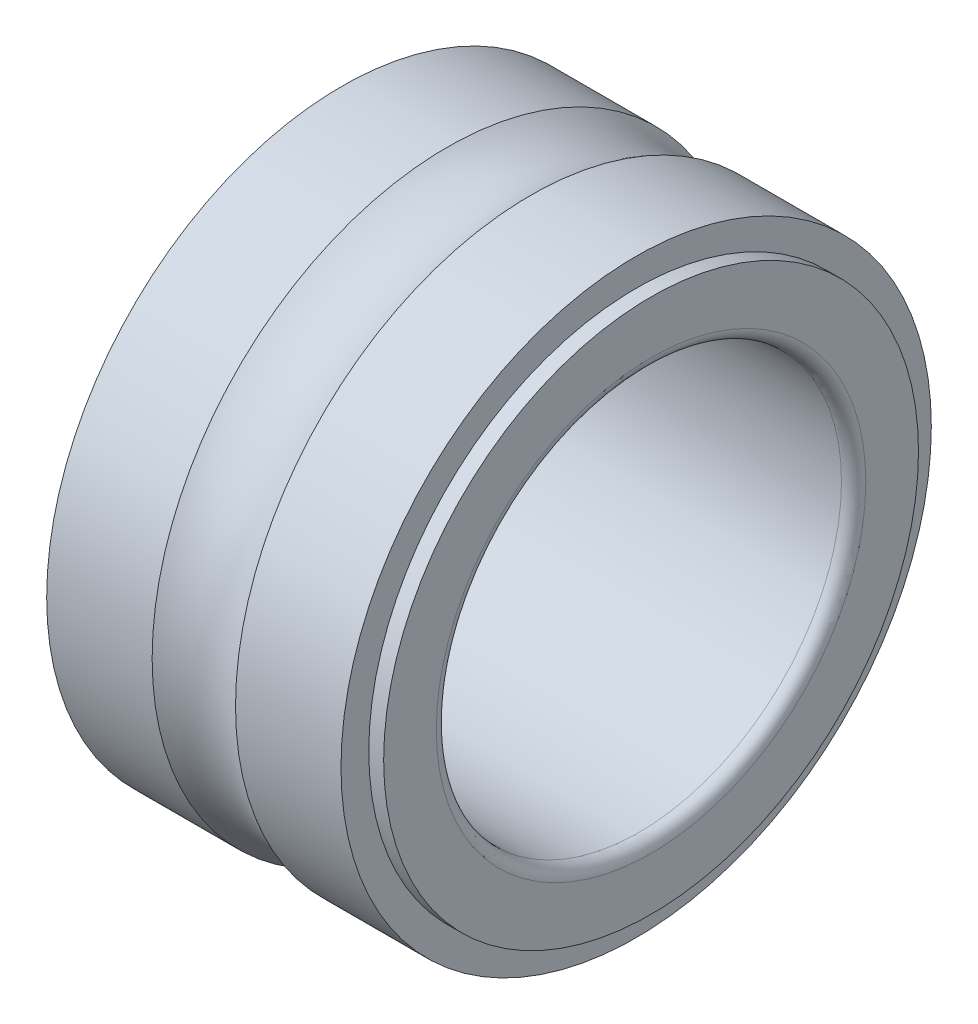
ISO-10303-21;
HEADER;
FILE_DESCRIPTION(('STEP AP214'),'2;1');
FILE_NAME('part.step','',(''),(''),'','','');
FILE_SCHEMA(('AUTOMOTIVE_DESIGN { 1 0 10303 214 1 1 1 1 }'));
ENDSEC;
DATA;
#1=APPLICATION_CONTEXT('core data for automotive mechanical design processes');
#2=APPLICATION_PROTOCOL_DEFINITION('international standard','automotive_design',2000,#1);
#3=PRODUCT_CONTEXT('',#1,'mechanical');
#4=PRODUCT('Part','Part','',(#3));
#5=PRODUCT_RELATED_PRODUCT_CATEGORY('part','',(#4));
#6=PRODUCT_DEFINITION_FORMATION('','',#4);
#7=PRODUCT_DEFINITION_CONTEXT('part definition',#1,'design');
#8=PRODUCT_DEFINITION('design','',#6,#7);
#9=PRODUCT_DEFINITION_SHAPE('','',#8);
#10=(LENGTH_UNIT() NAMED_UNIT(*) SI_UNIT(.MILLI.,.METRE.));
#11=(NAMED_UNIT(*) PLANE_ANGLE_UNIT() SI_UNIT($,.RADIAN.));
#12=(NAMED_UNIT(*) SI_UNIT($,.STERADIAN.) SOLID_ANGLE_UNIT());
#13=UNCERTAINTY_MEASURE_WITH_UNIT(LENGTH_MEASURE(1.E-05),#10,'distance_accuracy_value','');
#14=(GEOMETRIC_REPRESENTATION_CONTEXT(3) GLOBAL_UNCERTAINTY_ASSIGNED_CONTEXT((#13)) GLOBAL_UNIT_ASSIGNED_CONTEXT((#10,
#11,#12)) REPRESENTATION_CONTEXT('',''));
#15=CARTESIAN_POINT('',(0.,0.,0.));
#16=DIRECTION('',(0.,0.,1.));
#17=DIRECTION('',(1.,0.,0.));
#18=AXIS2_PLACEMENT_3D('',#15,#16,#17);
#19=CARTESIAN_POINT('',(4.,0.,0.));
#20=DIRECTION('',(1.,0.,0.));
#21=DIRECTION('',(0.,0.,-1.));
#22=AXIS2_PLACEMENT_3D('',#19,#20,#21);
#23=TOROIDAL_SURFACE('',#22,9.00000000000004,2.00000000000004);
#24=CARTESIAN_POINT('',(5.0289679295294,0.,0.));
#25=DIRECTION('',(1.,0.,0.));
#26=DIRECTION('',(0.,0.,-1.));
#27=AXIS2_PLACEMENT_3D('',#24,#25,#26);
#28=CIRCLE('',#27,7.285);
#29=CARTESIAN_POINT('',(5.0289679295294,0.,-7.285));
#30=VERTEX_POINT('',#29);
#31=EDGE_CURVE('E137',#30,#30,#28,.T.);
#32=ORIENTED_EDGE('',*,*,#31,.F.);
#33=EDGE_LOOP('',(#32));
#34=FACE_BOUND('',#33,.T.);
#35=CARTESIAN_POINT('',(2.9710320704706,0.,0.));
#36=DIRECTION('',(1.,0.,0.));
#37=DIRECTION('',(0.,0.,-1.));
#38=AXIS2_PLACEMENT_3D('',#35,#36,#37);
#39=CIRCLE('',#38,7.285);
#40=CARTESIAN_POINT('',(2.9710320704706,0.,-7.285));
#41=VERTEX_POINT('',#40);
#42=EDGE_CURVE('E140',#41,#41,#39,.F.);
#43=ORIENTED_EDGE('',*,*,#42,.F.);
#44=EDGE_LOOP('',(#43));
#45=FACE_BOUND('',#44,.T.);
#46=ADVANCED_FACE('F14',(#34,#45),#23,.F.);
#47=CARTESIAN_POINT('',(1.6695160352353,0.,0.));
#48=DIRECTION('',(1.,0.,0.));
#49=DIRECTION('',(0.,0.,-1.));
#50=AXIS2_PLACEMENT_3D('',#47,#48,#49);
#51=CYLINDRICAL_SURFACE('',#50,7.285);
#52=CARTESIAN_POINT('',(0.368,0.,0.));
#53=DIRECTION('',(1.,0.,0.));
#54=DIRECTION('',(0.,0.,-1.));
#55=AXIS2_PLACEMENT_3D('',#52,#53,#54);
#56=CIRCLE('',#55,7.285);
#57=CARTESIAN_POINT('',(0.368,0.,-7.285));
#58=VERTEX_POINT('',#57);
#59=EDGE_CURVE('E18',#58,#58,#56,.F.);
#60=ORIENTED_EDGE('',*,*,#59,.F.);
#61=EDGE_LOOP('',(#60));
#62=FACE_BOUND('',#61,.T.);
#63=ORIENTED_EDGE('',*,*,#42,.T.);
#64=EDGE_LOOP('',(#63));
#65=FACE_BOUND('',#64,.T.);
#66=ADVANCED_FACE('F96',(#62,#65),#51,.T.);
#67=CARTESIAN_POINT('',(6.3304839647647,0.,0.));
#68=DIRECTION('',(1.,0.,0.));
#69=DIRECTION('',(0.,0.,-1.));
#70=AXIS2_PLACEMENT_3D('',#67,#68,#69);
#71=CYLINDRICAL_SURFACE('',#70,7.285);
#72=ORIENTED_EDGE('',*,*,#31,.T.);
#73=EDGE_LOOP('',(#72));
#74=FACE_BOUND('',#73,.T.);
#75=CARTESIAN_POINT('',(7.632,0.,0.));
#76=DIRECTION('',(1.,0.,0.));
#77=DIRECTION('',(0.,0.,-1.));
#78=AXIS2_PLACEMENT_3D('',#75,#76,#77);
#79=CIRCLE('',#78,7.285);
#80=CARTESIAN_POINT('',(7.632,0.,-7.285));
#81=VERTEX_POINT('',#80);
#82=EDGE_CURVE('E132',#81,#81,#79,.T.);
#83=ORIENTED_EDGE('',*,*,#82,.F.);
#84=EDGE_LOOP('',(#83));
#85=FACE_BOUND('',#84,.T.);
#86=ADVANCED_FACE('F93',(#74,#85),#71,.T.);
#87=CARTESIAN_POINT('',(0.368,7.285,0.));
#88=DIRECTION('',(-1.,0.,0.));
#89=DIRECTION('',(0.,0.,1.));
#90=AXIS2_PLACEMENT_3D('',#87,#88,#89);
#91=PLANE('',#90);
#92=CARTESIAN_POINT('',(0.368,0.,0.));
#93=DIRECTION('',(1.,0.,0.));
#94=DIRECTION('',(0.,0.,-1.));
#95=AXIS2_PLACEMENT_3D('',#92,#93,#94);
#96=CIRCLE('',#95,6.6);
#97=CARTESIAN_POINT('',(0.368,0.,-6.6));
#98=VERTEX_POINT('',#97);
#99=EDGE_CURVE('E130',#98,#98,#96,.F.);
#100=ORIENTED_EDGE('',*,*,#99,.F.);
#101=EDGE_LOOP('',(#100));
#102=FACE_BOUND('',#101,.T.);
#103=ORIENTED_EDGE('',*,*,#59,.T.);
#104=EDGE_LOOP('',(#103));
#105=FACE_BOUND('',#104,.T.);
#106=ADVANCED_FACE('F89',(#102,#105),#91,.T.);
#107=CARTESIAN_POINT('',(7.632,6.6,0.));
#108=DIRECTION('',(1.,0.,0.));
#109=DIRECTION('',(0.,0.,-1.));
#110=AXIS2_PLACEMENT_3D('',#107,#108,#109);
#111=PLANE('',#110);
#112=CARTESIAN_POINT('',(7.632,0.,0.));
#113=DIRECTION('',(1.,0.,0.));
#114=DIRECTION('',(0.,0.,-1.));
#115=AXIS2_PLACEMENT_3D('',#112,#113,#114);
#116=CIRCLE('',#115,6.6);
#117=CARTESIAN_POINT('',(7.632,0.,-6.6));
#118=VERTEX_POINT('',#117);
#119=EDGE_CURVE('E123',#118,#118,#116,.T.);
#120=ORIENTED_EDGE('',*,*,#119,.F.);
#121=EDGE_LOOP('',(#120));
#122=FACE_BOUND('',#121,.T.);
#123=ORIENTED_EDGE('',*,*,#82,.T.);
#124=EDGE_LOOP('',(#123));
#125=FACE_BOUND('',#124,.T.);
#126=ADVANCED_FACE('F85',(#122,#125),#111,.T.);
#127=CARTESIAN_POINT('',(0.184,0.,0.));
#128=DIRECTION('',(1.,0.,0.));
#129=DIRECTION('',(0.,0.,-1.));
#130=AXIS2_PLACEMENT_3D('',#127,#128,#129);
#131=CYLINDRICAL_SURFACE('',#130,6.6);
#132=CARTESIAN_POINT('',(0.,0.,0.));
#133=DIRECTION('',(1.,0.,0.));
#134=DIRECTION('',(0.,0.,-1.));
#135=AXIS2_PLACEMENT_3D('',#132,#133,#134);
#136=CIRCLE('',#135,6.6);
#137=CARTESIAN_POINT('',(0.,0.,-6.6));
#138=VERTEX_POINT('',#137);
#139=EDGE_CURVE('E118',#138,#138,#136,.F.);
#140=ORIENTED_EDGE('',*,*,#139,.F.);
#141=EDGE_LOOP('',(#140));
#142=FACE_BOUND('',#141,.T.);
#143=ORIENTED_EDGE('',*,*,#99,.T.);
#144=EDGE_LOOP('',(#143));
#145=FACE_BOUND('',#144,.T.);
#146=ADVANCED_FACE('F81',(#142,#145),#131,.T.);
#147=CARTESIAN_POINT('',(7.816,0.,0.));
#148=DIRECTION('',(1.,0.,0.));
#149=DIRECTION('',(0.,0.,-1.));
#150=AXIS2_PLACEMENT_3D('',#147,#148,#149);
#151=CYLINDRICAL_SURFACE('',#150,6.6);
#152=ORIENTED_EDGE('',*,*,#119,.T.);
#153=EDGE_LOOP('',(#152));
#154=FACE_BOUND('',#153,.T.);
#155=CARTESIAN_POINT('',(8.,0.,0.));
#156=DIRECTION('',(1.,0.,0.));
#157=DIRECTION('',(0.,0.,-1.));
#158=AXIS2_PLACEMENT_3D('',#155,#156,#157);
#159=CIRCLE('',#158,6.6);
#160=CARTESIAN_POINT('',(8.,0.,-6.6));
#161=VERTEX_POINT('',#160);
#162=EDGE_CURVE('E116',#161,#161,#159,.T.);
#163=ORIENTED_EDGE('',*,*,#162,.F.);
#164=EDGE_LOOP('',(#163));
#165=FACE_BOUND('',#164,.T.);
#166=ADVANCED_FACE('F77',(#154,#165),#151,.T.);
#167=CARTESIAN_POINT('',(0.,6.6,0.));
#168=DIRECTION('',(-1.,0.,0.));
#169=DIRECTION('',(0.,0.,1.));
#170=AXIS2_PLACEMENT_3D('',#167,#168,#169);
#171=PLANE('',#170);
#172=CARTESIAN_POINT('',(0.,0.,0.));
#173=DIRECTION('',(-1.,0.,0.));
#174=DIRECTION('',(0.,0.,1.));
#175=AXIS2_PLACEMENT_3D('',#172,#173,#174);
#176=CIRCLE('',#175,5.3);
#177=CARTESIAN_POINT('',(0.,0.,5.3));
#178=VERTEX_POINT('',#177);
#179=EDGE_CURVE('E61',#178,#178,#176,.T.);
#180=ORIENTED_EDGE('',*,*,#179,.F.);
#181=EDGE_LOOP('',(#180));
#182=FACE_BOUND('',#181,.T.);
#183=ORIENTED_EDGE('',*,*,#139,.T.);
#184=EDGE_LOOP('',(#183));
#185=FACE_BOUND('',#184,.T.);
#186=ADVANCED_FACE('F67',(#182,#185),#171,.T.);
#187=CARTESIAN_POINT('',(8.,5.3,0.));
#188=DIRECTION('',(1.,0.,0.));
#189=DIRECTION('',(0.,0.,-1.));
#190=AXIS2_PLACEMENT_3D('',#187,#188,#189);
#191=PLANE('',#190);
#192=CARTESIAN_POINT('',(8.,0.,0.));
#193=DIRECTION('',(1.,0.,0.));
#194=DIRECTION('',(0.,0.,1.));
#195=AXIS2_PLACEMENT_3D('',#192,#193,#194);
#196=CIRCLE('',#195,5.3);
#197=CARTESIAN_POINT('',(8.,0.,5.3));
#198=VERTEX_POINT('',#197);
#199=EDGE_CURVE('E27',#198,#198,#196,.T.);
#200=ORIENTED_EDGE('',*,*,#199,.F.);
#201=EDGE_LOOP('',(#200));
#202=FACE_BOUND('',#201,.T.);
#203=ORIENTED_EDGE('',*,*,#162,.T.);
#204=EDGE_LOOP('',(#203));
#205=FACE_BOUND('',#204,.T.);
#206=ADVANCED_FACE('F76',(#202,#205),#191,.T.);
#207=CARTESIAN_POINT('',(0.299999999999939,0.,0.));
#208=DIRECTION('',(1.,0.,0.));
#209=DIRECTION('',(0.,0.,-1.));
#210=AXIS2_PLACEMENT_3D('',#207,#208,#209);
#211=TOROIDAL_SURFACE('',#210,5.29999999999994,0.299999999999939);
#212=CARTESIAN_POINT('',(0.3,0.,0.));
#213=DIRECTION('',(1.,0.,0.));
#214=DIRECTION('',(0.,0.,-1.));
#215=AXIS2_PLACEMENT_3D('',#212,#213,#214);
#216=CIRCLE('',#215,5.);
#217=CARTESIAN_POINT('',(0.3,0.,-5.));
#218=VERTEX_POINT('',#217);
#219=EDGE_CURVE('E22',#218,#218,#216,.T.);
#220=ORIENTED_EDGE('',*,*,#219,.T.);
#221=EDGE_LOOP('',(#220));
#222=FACE_BOUND('',#221,.T.);
#223=ORIENTED_EDGE('',*,*,#179,.T.);
#224=EDGE_LOOP('',(#223));
#225=FACE_BOUND('',#224,.T.);
#226=ADVANCED_FACE('F41',(#222,#225),#211,.T.);
#227=CARTESIAN_POINT('',(7.70000000000012,0.,0.));
#228=DIRECTION('',(1.,0.,0.));
#229=DIRECTION('',(0.,0.,-1.));
#230=AXIS2_PLACEMENT_3D('',#227,#228,#229);
#231=TOROIDAL_SURFACE('',#230,5.29999999999988,0.299999999999876);
#232=ORIENTED_EDGE('',*,*,#199,.T.);
#233=EDGE_LOOP('',(#232));
#234=FACE_BOUND('',#233,.T.);
#235=CARTESIAN_POINT('',(7.7,0.,0.));
#236=DIRECTION('',(1.,0.,0.));
#237=DIRECTION('',(0.,0.,-1.));
#238=AXIS2_PLACEMENT_3D('',#235,#236,#237);
#239=CIRCLE('',#238,5.);
#240=CARTESIAN_POINT('',(7.7,0.,-5.));
#241=VERTEX_POINT('',#240);
#242=EDGE_CURVE('E10',#241,#241,#239,.F.);
#243=ORIENTED_EDGE('',*,*,#242,.T.);
#244=EDGE_LOOP('',(#243));
#245=FACE_BOUND('',#244,.T.);
#246=ADVANCED_FACE('F35',(#234,#245),#231,.T.);
#247=CARTESIAN_POINT('',(4.,0.,0.));
#248=DIRECTION('',(1.,0.,0.));
#249=DIRECTION('',(0.,0.,-1.));
#250=AXIS2_PLACEMENT_3D('',#247,#248,#249);
#251=CYLINDRICAL_SURFACE('',#250,5.);
#252=ORIENTED_EDGE('',*,*,#219,.F.);
#253=EDGE_LOOP('',(#252));
#254=FACE_BOUND('',#253,.T.);
#255=ORIENTED_EDGE('',*,*,#242,.F.);
#256=EDGE_LOOP('',(#255));
#257=FACE_BOUND('',#256,.T.);
#258=ADVANCED_FACE('F40',(#254,#257),#251,.F.);
#259=CLOSED_SHELL('',(#46,#66,#86,#106,#126,#146,#166,#186,#206,#226,#246,#258));
#260=MANIFOLD_SOLID_BREP('B1',#259);
#261=ADVANCED_BREP_SHAPE_REPRESENTATION('',(#18,#260),#14);
#262=SHAPE_DEFINITION_REPRESENTATION(#9,#261);
ENDSEC;
END-ISO-10303-21;
